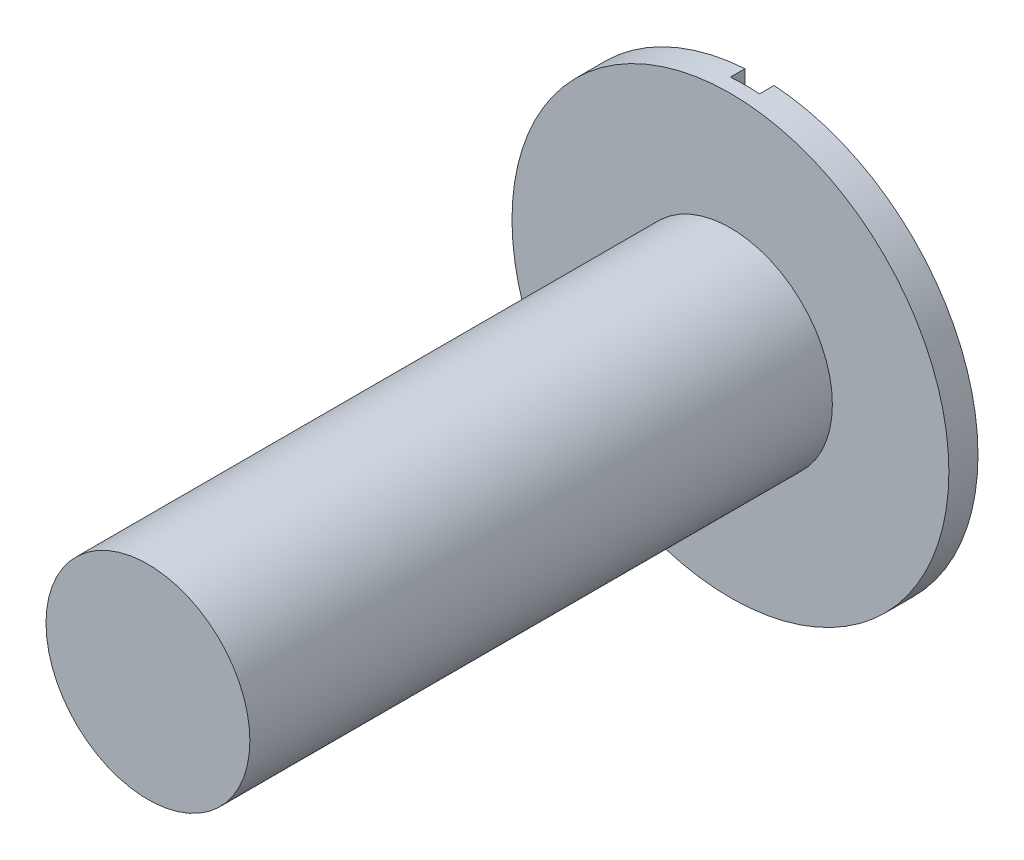
ISO-10303-21;
HEADER;
FILE_DESCRIPTION(('STEP AP214'),'2;1');
FILE_NAME('part.step','',(''),(''),'','','');
FILE_SCHEMA(('AUTOMOTIVE_DESIGN { 1 0 10303 214 1 1 1 1 }'));
ENDSEC;
DATA;
#1=APPLICATION_CONTEXT('core data for automotive mechanical design processes');
#2=APPLICATION_PROTOCOL_DEFINITION('international standard','automotive_design',2000,#1);
#3=PRODUCT_CONTEXT('',#1,'mechanical');
#4=PRODUCT('Part','Part','',(#3));
#5=PRODUCT_RELATED_PRODUCT_CATEGORY('part','',(#4));
#6=PRODUCT_DEFINITION_FORMATION('','',#4);
#7=PRODUCT_DEFINITION_CONTEXT('part definition',#1,'design');
#8=PRODUCT_DEFINITION('design','',#6,#7);
#9=PRODUCT_DEFINITION_SHAPE('','',#8);
#10=(LENGTH_UNIT() NAMED_UNIT(*) SI_UNIT(.MILLI.,.METRE.));
#11=(NAMED_UNIT(*) PLANE_ANGLE_UNIT() SI_UNIT($,.RADIAN.));
#12=(NAMED_UNIT(*) SI_UNIT($,.STERADIAN.) SOLID_ANGLE_UNIT());
#13=UNCERTAINTY_MEASURE_WITH_UNIT(LENGTH_MEASURE(1.E-05),#10,'distance_accuracy_value','');
#14=(GEOMETRIC_REPRESENTATION_CONTEXT(3) GLOBAL_UNCERTAINTY_ASSIGNED_CONTEXT((#13)) GLOBAL_UNIT_ASSIGNED_CONTEXT((#10,
#11,#12)) REPRESENTATION_CONTEXT('',''));
#15=CARTESIAN_POINT('',(0.,0.,0.));
#16=DIRECTION('',(0.,0.,1.));
#17=DIRECTION('',(1.,0.,0.));
#18=AXIS2_PLACEMENT_3D('',#15,#16,#17);
#19=CARTESIAN_POINT('',(0.,0.,0.));
#20=DIRECTION('',(0.,0.,1.));
#21=DIRECTION('',(1.,0.,0.));
#22=AXIS2_PLACEMENT_3D('',#19,#20,#21);
#23=PLANE('',#22);
#24=CARTESIAN_POINT('',(0.,0.,0.));
#25=DIRECTION('',(0.,0.,1.));
#26=DIRECTION('',(1.,0.,0.));
#27=AXIS2_PLACEMENT_3D('',#24,#25,#26);
#28=CIRCLE('',#27,0.75);
#29=CARTESIAN_POINT('',(-0.0499999999999999,0.748331477354788,0.));
#30=VERTEX_POINT('',#29);
#31=CARTESIAN_POINT('',(-0.0500000000000001,-0.748331477354788,0.));
#32=VERTEX_POINT('',#31);
#33=EDGE_CURVE('E94',#30,#32,#28,.T.);
#34=ORIENTED_EDGE('',*,*,#33,.F.);
#35=DIRECTION('',(0.,-1.,0.));
#36=VECTOR('',#35,1.);
#37=CARTESIAN_POINT('',(-0.05,0.,0.));
#38=LINE('',#37,#36);
#39=EDGE_CURVE('E82',#30,#32,#38,.T.);
#40=ORIENTED_EDGE('',*,*,#39,.T.);
#41=EDGE_LOOP('',(#34,#40));
#42=FACE_BOUND('',#41,.T.);
#43=ADVANCED_FACE('F35',(#42),#23,.F.);
#44=CARTESIAN_POINT('',(0.,0.,0.1));
#45=DIRECTION('',(0.,0.,1.));
#46=DIRECTION('',(1.,0.,0.));
#47=AXIS2_PLACEMENT_3D('',#44,#45,#46);
#48=PLANE('',#47);
#49=CARTESIAN_POINT('',(0.,0.,0.1));
#50=DIRECTION('',(0.,0.,1.));
#51=DIRECTION('',(1.,0.,0.));
#52=AXIS2_PLACEMENT_3D('',#49,#50,#51);
#53=CIRCLE('',#52,0.75);
#54=CARTESIAN_POINT('',(0.75,0.,0.1));
#55=VERTEX_POINT('',#54);
#56=EDGE_CURVE('E83',#55,#55,#53,.T.);
#57=ORIENTED_EDGE('',*,*,#56,.T.);
#58=EDGE_LOOP('',(#57));
#59=FACE_BOUND('',#58,.T.);
#60=CARTESIAN_POINT('',(0.,0.,0.1));
#61=DIRECTION('',(0.,0.,1.));
#62=DIRECTION('',(1.,0.,0.));
#63=AXIS2_PLACEMENT_3D('',#60,#61,#62);
#64=CIRCLE('',#63,0.35);
#65=CARTESIAN_POINT('',(0.35,0.,0.1));
#66=VERTEX_POINT('',#65);
#67=EDGE_CURVE('E99',#66,#66,#64,.T.);
#68=ORIENTED_EDGE('',*,*,#67,.F.);
#69=EDGE_LOOP('',(#68));
#70=FACE_BOUND('',#69,.T.);
#71=ADVANCED_FACE('F120',(#59,#70),#48,.T.);
#72=CARTESIAN_POINT('',(0.,0.,0.1));
#73=DIRECTION('',(0.,0.,-1.));
#74=DIRECTION('',(-1.,0.,0.));
#75=AXIS2_PLACEMENT_3D('',#72,#73,#74);
#76=CYLINDRICAL_SURFACE('',#75,0.75);
#77=CARTESIAN_POINT('',(0.,0.,0.05));
#78=DIRECTION('',(0.,0.,-1.));
#79=DIRECTION('',(-1.,0.,0.));
#80=AXIS2_PLACEMENT_3D('',#77,#78,#79);
#81=CIRCLE('',#80,0.75);
#82=CARTESIAN_POINT('',(-0.0499999999999999,0.748331477354788,0.05));
#83=VERTEX_POINT('',#82);
#84=CARTESIAN_POINT('',(0.0500000000000001,0.748331477354788,0.05));
#85=VERTEX_POINT('',#84);
#86=EDGE_CURVE('E11',#83,#85,#81,.T.);
#87=ORIENTED_EDGE('',*,*,#86,.F.);
#88=DIRECTION('',(0.,0.,-1.));
#89=VECTOR('',#88,1.);
#90=CARTESIAN_POINT('',(-0.0499999999999999,0.748331477354788,0.1));
#91=LINE('',#90,#89);
#92=EDGE_CURVE('E58',#83,#30,#91,.T.);
#93=ORIENTED_EDGE('',*,*,#92,.T.);
#94=ORIENTED_EDGE('',*,*,#33,.T.);
#95=DIRECTION('',(0.,0.,-1.));
#96=VECTOR('',#95,1.);
#97=CARTESIAN_POINT('',(-0.0500000000000001,-0.748331477354788,0.1));
#98=LINE('',#97,#96);
#99=CARTESIAN_POINT('',(-0.0500000000000001,-0.748331477354788,0.05));
#100=VERTEX_POINT('',#99);
#101=EDGE_CURVE('E91',#32,#100,#98,.F.);
#102=ORIENTED_EDGE('',*,*,#101,.T.);
#103=CARTESIAN_POINT('',(0.0499999999999999,-0.748331477354788,0.05));
#104=VERTEX_POINT('',#103);
#105=EDGE_CURVE('E39',#104,#100,#81,.T.);
#106=ORIENTED_EDGE('',*,*,#105,.F.);
#107=DIRECTION('',(0.,0.,-1.));
#108=VECTOR('',#107,1.);
#109=CARTESIAN_POINT('',(0.0499999999999999,-0.748331477354788,0.1));
#110=LINE('',#109,#108);
#111=CARTESIAN_POINT('',(0.0499999999999999,-0.748331477354788,0.));
#112=VERTEX_POINT('',#111);
#113=EDGE_CURVE('E77',#104,#112,#110,.T.);
#114=ORIENTED_EDGE('',*,*,#113,.T.);
#115=CARTESIAN_POINT('',(0.0500000000000001,0.748331477354788,0.));
#116=VERTEX_POINT('',#115);
#117=EDGE_CURVE('E89',#112,#116,#28,.T.);
#118=ORIENTED_EDGE('',*,*,#117,.T.);
#119=DIRECTION('',(0.,0.,-1.));
#120=VECTOR('',#119,1.);
#121=CARTESIAN_POINT('',(0.0500000000000001,0.748331477354788,0.1));
#122=LINE('',#121,#120);
#123=EDGE_CURVE('E50',#116,#85,#122,.F.);
#124=ORIENTED_EDGE('',*,*,#123,.T.);
#125=EDGE_LOOP('',(#87,#93,#94,#102,#106,#114,#118,#124));
#126=FACE_BOUND('',#125,.T.);
#127=ORIENTED_EDGE('',*,*,#56,.F.);
#128=EDGE_LOOP('',(#127));
#129=FACE_BOUND('',#128,.T.);
#130=ADVANCED_FACE('F37',(#126,#129),#76,.T.);
#131=ORIENTED_EDGE('',*,*,#117,.F.);
#132=DIRECTION('',(0.,1.,0.));
#133=VECTOR('',#132,1.);
#134=CARTESIAN_POINT('',(0.05,0.,0.));
#135=LINE('',#134,#133);
#136=EDGE_CURVE('E74',#112,#116,#135,.T.);
#137=ORIENTED_EDGE('',*,*,#136,.T.);
#138=EDGE_LOOP('',(#131,#137));
#139=FACE_BOUND('',#138,.T.);
#140=ADVANCED_FACE('F93',(#139),#23,.F.);
#141=CARTESIAN_POINT('',(0.,0.,2.1));
#142=DIRECTION('',(0.,0.,-1.));
#143=DIRECTION('',(-1.,0.,0.));
#144=AXIS2_PLACEMENT_3D('',#141,#142,#143);
#145=CYLINDRICAL_SURFACE('',#144,0.35);
#146=CARTESIAN_POINT('',(0.,0.,2.1));
#147=DIRECTION('',(0.,0.,1.));
#148=DIRECTION('',(1.,0.,0.));
#149=AXIS2_PLACEMENT_3D('',#146,#147,#148);
#150=CIRCLE('',#149,0.35);
#151=CARTESIAN_POINT('',(0.35,0.,2.1));
#152=VERTEX_POINT('',#151);
#153=EDGE_CURVE('E95',#152,#152,#150,.T.);
#154=ORIENTED_EDGE('',*,*,#153,.F.);
#155=EDGE_LOOP('',(#154));
#156=FACE_BOUND('',#155,.T.);
#157=ORIENTED_EDGE('',*,*,#67,.T.);
#158=EDGE_LOOP('',(#157));
#159=FACE_BOUND('',#158,.T.);
#160=ADVANCED_FACE('F118',(#156,#159),#145,.T.);
#161=CARTESIAN_POINT('',(0.,0.,2.1));
#162=DIRECTION('',(0.,0.,1.));
#163=DIRECTION('',(1.,0.,0.));
#164=AXIS2_PLACEMENT_3D('',#161,#162,#163);
#165=PLANE('',#164);
#166=ORIENTED_EDGE('',*,*,#153,.T.);
#167=EDGE_LOOP('',(#166));
#168=FACE_BOUND('',#167,.T.);
#169=ADVANCED_FACE('F135',(#168),#165,.T.);
#170=CARTESIAN_POINT('',(0.,0.,0.05));
#171=DIRECTION('',(0.,0.,-1.));
#172=DIRECTION('',(-1.,0.,0.));
#173=AXIS2_PLACEMENT_3D('',#170,#171,#172);
#174=PLANE('',#173);
#175=ORIENTED_EDGE('',*,*,#86,.T.);
#176=DIRECTION('',(0.,-1.,0.));
#177=VECTOR('',#176,1.);
#178=CARTESIAN_POINT('',(0.0500000000000001,0.810715774948132,0.05));
#179=LINE('',#178,#177);
#180=EDGE_CURVE('E109',#85,#104,#179,.T.);
#181=ORIENTED_EDGE('',*,*,#180,.T.);
#182=ORIENTED_EDGE('',*,*,#105,.T.);
#183=DIRECTION('',(0.,1.,0.));
#184=VECTOR('',#183,1.);
#185=CARTESIAN_POINT('',(-0.0499999999999999,0.810715774948132,0.05));
#186=LINE('',#185,#184);
#187=EDGE_CURVE('E108',#100,#83,#186,.T.);
#188=ORIENTED_EDGE('',*,*,#187,.T.);
#189=EDGE_LOOP('',(#175,#181,#182,#188));
#190=FACE_BOUND('',#189,.T.);
#191=ADVANCED_FACE('F107',(#190),#174,.T.);
#192=CARTESIAN_POINT('',(-0.0499999999999999,0.810715774948132,0.05));
#193=DIRECTION('',(-1.,0.,0.));
#194=DIRECTION('',(0.,-1.,0.));
#195=AXIS2_PLACEMENT_3D('',#192,#193,#194);
#196=PLANE('',#195);
#197=ORIENTED_EDGE('',*,*,#187,.F.);
#198=ORIENTED_EDGE('',*,*,#101,.F.);
#199=ORIENTED_EDGE('',*,*,#39,.F.);
#200=ORIENTED_EDGE('',*,*,#92,.F.);
#201=EDGE_LOOP('',(#197,#198,#199,#200));
#202=FACE_BOUND('',#201,.T.);
#203=ADVANCED_FACE('F110',(#202),#196,.F.);
#204=CARTESIAN_POINT('',(0.0500000000000001,0.810715774948132,0.05));
#205=DIRECTION('',(1.,0.,0.));
#206=DIRECTION('',(0.,1.,0.));
#207=AXIS2_PLACEMENT_3D('',#204,#205,#206);
#208=PLANE('',#207);
#209=ORIENTED_EDGE('',*,*,#180,.F.);
#210=ORIENTED_EDGE('',*,*,#123,.F.);
#211=ORIENTED_EDGE('',*,*,#136,.F.);
#212=ORIENTED_EDGE('',*,*,#113,.F.);
#213=EDGE_LOOP('',(#209,#210,#211,#212));
#214=FACE_BOUND('',#213,.T.);
#215=ADVANCED_FACE('F76',(#214),#208,.F.);
#216=CLOSED_SHELL('',(#43,#71,#130,#140,#160,#169,#191,#203,#215));
#217=MANIFOLD_SOLID_BREP('B2',#216);
#218=ADVANCED_BREP_SHAPE_REPRESENTATION('',(#18,#217),#14);
#219=SHAPE_DEFINITION_REPRESENTATION(#9,#218);
ENDSEC;
END-ISO-10303-21;
